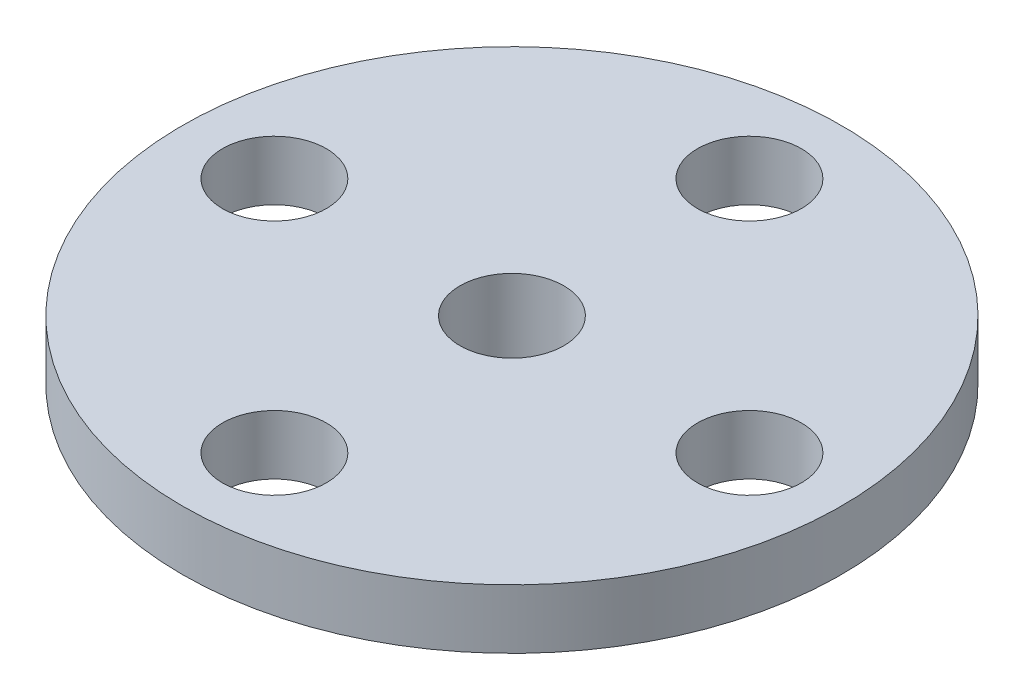
ISO-10303-21;
HEADER;
FILE_DESCRIPTION(('STEP AP214'),'2;1');
FILE_NAME('part.step','',(''),(''),'','','');
FILE_SCHEMA(('AUTOMOTIVE_DESIGN { 1 0 10303 214 1 1 1 1 }'));
ENDSEC;
DATA;
#1=APPLICATION_CONTEXT('core data for automotive mechanical design processes');
#2=APPLICATION_PROTOCOL_DEFINITION('international standard','automotive_design',2000,#1);
#3=PRODUCT_CONTEXT('',#1,'mechanical');
#4=PRODUCT('Part','Part','',(#3));
#5=PRODUCT_RELATED_PRODUCT_CATEGORY('part','',(#4));
#6=PRODUCT_DEFINITION_FORMATION('','',#4);
#7=PRODUCT_DEFINITION_CONTEXT('part definition',#1,'design');
#8=PRODUCT_DEFINITION('design','',#6,#7);
#9=PRODUCT_DEFINITION_SHAPE('','',#8);
#10=(LENGTH_UNIT() NAMED_UNIT(*) SI_UNIT(.MILLI.,.METRE.));
#11=(NAMED_UNIT(*) PLANE_ANGLE_UNIT() SI_UNIT($,.RADIAN.));
#12=(NAMED_UNIT(*) SI_UNIT($,.STERADIAN.) SOLID_ANGLE_UNIT());
#13=UNCERTAINTY_MEASURE_WITH_UNIT(LENGTH_MEASURE(1.E-05),#10,'distance_accuracy_value','');
#14=(GEOMETRIC_REPRESENTATION_CONTEXT(3) GLOBAL_UNCERTAINTY_ASSIGNED_CONTEXT((#13)) GLOBAL_UNIT_ASSIGNED_CONTEXT((#10,
#11,#12)) REPRESENTATION_CONTEXT('',''));
#15=CARTESIAN_POINT('',(0.,0.,0.));
#16=DIRECTION('',(0.,0.,1.));
#17=DIRECTION('',(1.,0.,0.));
#18=AXIS2_PLACEMENT_3D('',#15,#16,#17);
#19=CARTESIAN_POINT('',(0.,0.,0.));
#20=DIRECTION('',(0.,1.,0.));
#21=DIRECTION('',(0.,0.,1.));
#22=AXIS2_PLACEMENT_3D('',#19,#20,#21);
#23=PLANE('',#22);
#24=CARTESIAN_POINT('',(0.,0.,0.));
#25=DIRECTION('',(0.,1.,0.));
#26=DIRECTION('',(0.,0.,1.));
#27=AXIS2_PLACEMENT_3D('',#24,#25,#26);
#28=CIRCLE('',#27,11.1);
#29=CARTESIAN_POINT('',(0.,0.,11.1));
#30=VERTEX_POINT('',#29);
#31=EDGE_CURVE('E39',#30,#30,#28,.T.);
#32=ORIENTED_EDGE('',*,*,#31,.F.);
#33=EDGE_LOOP('',(#32));
#34=FACE_BOUND('',#33,.T.);
#35=CARTESIAN_POINT('',(0.,0.,-8.));
#36=DIRECTION('',(0.,1.,0.));
#37=DIRECTION('',(0.,0.,1.));
#38=AXIS2_PLACEMENT_3D('',#35,#36,#37);
#39=CIRCLE('',#38,1.75);
#40=CARTESIAN_POINT('',(0.,0.,-6.25));
#41=VERTEX_POINT('',#40);
#42=EDGE_CURVE('E44',#41,#41,#39,.T.);
#43=ORIENTED_EDGE('',*,*,#42,.T.);
#44=EDGE_LOOP('',(#43));
#45=FACE_BOUND('',#44,.T.);
#46=CARTESIAN_POINT('',(8.,0.,0.));
#47=DIRECTION('',(0.,1.,0.));
#48=DIRECTION('',(0.,0.,1.));
#49=AXIS2_PLACEMENT_3D('',#46,#47,#48);
#50=CIRCLE('',#49,1.75);
#51=CARTESIAN_POINT('',(8.,0.,1.75));
#52=VERTEX_POINT('',#51);
#53=EDGE_CURVE('E49',#52,#52,#50,.T.);
#54=ORIENTED_EDGE('',*,*,#53,.T.);
#55=EDGE_LOOP('',(#54));
#56=FACE_BOUND('',#55,.T.);
#57=CARTESIAN_POINT('',(0.,0.,8.));
#58=DIRECTION('',(0.,1.,0.));
#59=DIRECTION('',(0.,0.,1.));
#60=AXIS2_PLACEMENT_3D('',#57,#58,#59);
#61=CIRCLE('',#60,1.75);
#62=CARTESIAN_POINT('',(0.,0.,9.75));
#63=VERTEX_POINT('',#62);
#64=EDGE_CURVE('E55',#63,#63,#61,.T.);
#65=ORIENTED_EDGE('',*,*,#64,.T.);
#66=EDGE_LOOP('',(#65));
#67=FACE_BOUND('',#66,.T.);
#68=CARTESIAN_POINT('',(-8.,0.,0.));
#69=DIRECTION('',(0.,1.,0.));
#70=DIRECTION('',(0.,0.,1.));
#71=AXIS2_PLACEMENT_3D('',#68,#69,#70);
#72=CIRCLE('',#71,1.75);
#73=CARTESIAN_POINT('',(-8.,0.,1.75));
#74=VERTEX_POINT('',#73);
#75=EDGE_CURVE('E61',#74,#74,#72,.T.);
#76=ORIENTED_EDGE('',*,*,#75,.T.);
#77=EDGE_LOOP('',(#76));
#78=FACE_BOUND('',#77,.T.);
#79=CARTESIAN_POINT('',(0.,0.,0.));
#80=DIRECTION('',(0.,1.,0.));
#81=DIRECTION('',(0.,0.,1.));
#82=AXIS2_PLACEMENT_3D('',#79,#80,#81);
#83=CIRCLE('',#82,4.4);
#84=CARTESIAN_POINT('',(0.,0.,4.4));
#85=VERTEX_POINT('',#84);
#86=EDGE_CURVE('E10',#85,#85,#83,.F.);
#87=ORIENTED_EDGE('',*,*,#86,.F.);
#88=EDGE_LOOP('',(#87));
#89=FACE_BOUND('',#88,.T.);
#90=ADVANCED_FACE('F28',(#34,#45,#56,#67,#78,#89),#23,.F.);
#91=CARTESIAN_POINT('',(0.,2.,0.));
#92=DIRECTION('',(0.,-1.,0.));
#93=DIRECTION('',(0.,0.,-1.));
#94=AXIS2_PLACEMENT_3D('',#91,#92,#93);
#95=CYLINDRICAL_SURFACE('',#94,11.1);
#96=CARTESIAN_POINT('',(0.,2.,0.));
#97=DIRECTION('',(0.,1.,0.));
#98=DIRECTION('',(0.,0.,1.));
#99=AXIS2_PLACEMENT_3D('',#96,#97,#98);
#100=CIRCLE('',#99,11.1);
#101=CARTESIAN_POINT('',(0.,2.,11.1));
#102=VERTEX_POINT('',#101);
#103=EDGE_CURVE('E35',#102,#102,#100,.T.);
#104=ORIENTED_EDGE('',*,*,#103,.F.);
#105=EDGE_LOOP('',(#104));
#106=FACE_BOUND('',#105,.T.);
#107=ORIENTED_EDGE('',*,*,#31,.T.);
#108=EDGE_LOOP('',(#107));
#109=FACE_BOUND('',#108,.T.);
#110=ADVANCED_FACE('F30',(#106,#109),#95,.T.);
#111=CARTESIAN_POINT('',(0.,2.,0.));
#112=DIRECTION('',(0.,1.,0.));
#113=DIRECTION('',(0.,0.,1.));
#114=AXIS2_PLACEMENT_3D('',#111,#112,#113);
#115=PLANE('',#114);
#116=CARTESIAN_POINT('',(0.,2.,0.));
#117=DIRECTION('',(0.,-1.,0.));
#118=DIRECTION('',(0.,0.,-1.));
#119=AXIS2_PLACEMENT_3D('',#116,#117,#118);
#120=CIRCLE('',#119,1.75);
#121=CARTESIAN_POINT('',(0.,2.,-1.75));
#122=VERTEX_POINT('',#121);
#123=EDGE_CURVE('E76',#122,#122,#120,.T.);
#124=ORIENTED_EDGE('',*,*,#123,.T.);
#125=EDGE_LOOP('',(#124));
#126=FACE_BOUND('',#125,.T.);
#127=CARTESIAN_POINT('',(-8.,2.,0.));
#128=DIRECTION('',(0.,1.,0.));
#129=DIRECTION('',(0.,0.,1.));
#130=AXIS2_PLACEMENT_3D('',#127,#128,#129);
#131=CIRCLE('',#130,1.75);
#132=CARTESIAN_POINT('',(-8.,2.,1.75));
#133=VERTEX_POINT('',#132);
#134=EDGE_CURVE('E64',#133,#133,#131,.T.);
#135=ORIENTED_EDGE('',*,*,#134,.F.);
#136=EDGE_LOOP('',(#135));
#137=FACE_BOUND('',#136,.T.);
#138=CARTESIAN_POINT('',(0.,2.,8.));
#139=DIRECTION('',(0.,1.,0.));
#140=DIRECTION('',(0.,0.,1.));
#141=AXIS2_PLACEMENT_3D('',#138,#139,#140);
#142=CIRCLE('',#141,1.75);
#143=CARTESIAN_POINT('',(0.,2.,9.75));
#144=VERTEX_POINT('',#143);
#145=EDGE_CURVE('E58',#144,#144,#142,.T.);
#146=ORIENTED_EDGE('',*,*,#145,.F.);
#147=EDGE_LOOP('',(#146));
#148=FACE_BOUND('',#147,.T.);
#149=CARTESIAN_POINT('',(8.,2.,0.));
#150=DIRECTION('',(0.,1.,0.));
#151=DIRECTION('',(0.,0.,1.));
#152=AXIS2_PLACEMENT_3D('',#149,#150,#151);
#153=CIRCLE('',#152,1.75);
#154=CARTESIAN_POINT('',(8.,2.,1.75));
#155=VERTEX_POINT('',#154);
#156=EDGE_CURVE('E52',#155,#155,#153,.T.);
#157=ORIENTED_EDGE('',*,*,#156,.F.);
#158=EDGE_LOOP('',(#157));
#159=FACE_BOUND('',#158,.T.);
#160=CARTESIAN_POINT('',(0.,2.,-8.));
#161=DIRECTION('',(0.,1.,0.));
#162=DIRECTION('',(0.,0.,1.));
#163=AXIS2_PLACEMENT_3D('',#160,#161,#162);
#164=CIRCLE('',#163,1.75);
#165=CARTESIAN_POINT('',(0.,2.,-6.25));
#166=VERTEX_POINT('',#165);
#167=EDGE_CURVE('E46',#166,#166,#164,.T.);
#168=ORIENTED_EDGE('',*,*,#167,.F.);
#169=EDGE_LOOP('',(#168));
#170=FACE_BOUND('',#169,.T.);
#171=ORIENTED_EDGE('',*,*,#103,.T.);
#172=EDGE_LOOP('',(#171));
#173=FACE_BOUND('',#172,.T.);
#174=ADVANCED_FACE('F85',(#126,#137,#148,#159,#170,#173),#115,.T.);
#175=CARTESIAN_POINT('',(0.,0.,-8.));
#176=DIRECTION('',(0.,1.,0.));
#177=DIRECTION('',(0.,0.,1.));
#178=AXIS2_PLACEMENT_3D('',#175,#176,#177);
#179=CYLINDRICAL_SURFACE('',#178,1.75);
#180=ORIENTED_EDGE('',*,*,#42,.F.);
#181=EDGE_LOOP('',(#180));
#182=FACE_BOUND('',#181,.T.);
#183=ORIENTED_EDGE('',*,*,#167,.T.);
#184=EDGE_LOOP('',(#183));
#185=FACE_BOUND('',#184,.T.);
#186=ADVANCED_FACE('F133',(#182,#185),#179,.F.);
#187=CARTESIAN_POINT('',(8.,0.,0.));
#188=DIRECTION('',(0.,1.,0.));
#189=DIRECTION('',(0.,0.,1.));
#190=AXIS2_PLACEMENT_3D('',#187,#188,#189);
#191=CYLINDRICAL_SURFACE('',#190,1.75);
#192=ORIENTED_EDGE('',*,*,#53,.F.);
#193=EDGE_LOOP('',(#192));
#194=FACE_BOUND('',#193,.T.);
#195=ORIENTED_EDGE('',*,*,#156,.T.);
#196=EDGE_LOOP('',(#195));
#197=FACE_BOUND('',#196,.T.);
#198=ADVANCED_FACE('F136',(#194,#197),#191,.F.);
#199=CARTESIAN_POINT('',(0.,0.,8.));
#200=DIRECTION('',(0.,1.,0.));
#201=DIRECTION('',(0.,0.,1.));
#202=AXIS2_PLACEMENT_3D('',#199,#200,#201);
#203=CYLINDRICAL_SURFACE('',#202,1.75);
#204=ORIENTED_EDGE('',*,*,#64,.F.);
#205=EDGE_LOOP('',(#204));
#206=FACE_BOUND('',#205,.T.);
#207=ORIENTED_EDGE('',*,*,#145,.T.);
#208=EDGE_LOOP('',(#207));
#209=FACE_BOUND('',#208,.T.);
#210=ADVANCED_FACE('F119',(#206,#209),#203,.F.);
#211=CARTESIAN_POINT('',(-8.,0.,0.));
#212=DIRECTION('',(0.,1.,0.));
#213=DIRECTION('',(0.,0.,1.));
#214=AXIS2_PLACEMENT_3D('',#211,#212,#213);
#215=CYLINDRICAL_SURFACE('',#214,1.75);
#216=ORIENTED_EDGE('',*,*,#75,.F.);
#217=EDGE_LOOP('',(#216));
#218=FACE_BOUND('',#217,.T.);
#219=ORIENTED_EDGE('',*,*,#134,.T.);
#220=EDGE_LOOP('',(#219));
#221=FACE_BOUND('',#220,.T.);
#222=ADVANCED_FACE('F114',(#218,#221),#215,.F.);
#223=CARTESIAN_POINT('',(0.,-4.2,0.));
#224=DIRECTION('',(0.,1.,0.));
#225=DIRECTION('',(0.,0.,1.));
#226=AXIS2_PLACEMENT_3D('',#223,#224,#225);
#227=CYLINDRICAL_SURFACE('',#226,4.4);
#228=CARTESIAN_POINT('',(0.,-4.2,0.));
#229=DIRECTION('',(0.,-1.,0.));
#230=DIRECTION('',(0.,0.,-1.));
#231=AXIS2_PLACEMENT_3D('',#228,#229,#230);
#232=CIRCLE('',#231,4.4);
#233=CARTESIAN_POINT('',(0.,-4.2,-4.4));
#234=VERTEX_POINT('',#233);
#235=EDGE_CURVE('E67',#234,#234,#232,.T.);
#236=ORIENTED_EDGE('',*,*,#235,.F.);
#237=EDGE_LOOP('',(#236));
#238=FACE_BOUND('',#237,.T.);
#239=ORIENTED_EDGE('',*,*,#86,.T.);
#240=EDGE_LOOP('',(#239));
#241=FACE_BOUND('',#240,.T.);
#242=ADVANCED_FACE('F109',(#238,#241),#227,.T.);
#243=CARTESIAN_POINT('',(0.,-4.2,0.));
#244=DIRECTION('',(0.,-1.,0.));
#245=DIRECTION('',(0.,0.,-1.));
#246=AXIS2_PLACEMENT_3D('',#243,#244,#245);
#247=PLANE('',#246);
#248=CARTESIAN_POINT('',(0.,-4.2,0.));
#249=DIRECTION('',(0.,-1.,0.));
#250=DIRECTION('',(0.,0.,-1.));
#251=AXIS2_PLACEMENT_3D('',#248,#249,#250);
#252=CIRCLE('',#251,2.85);
#253=CARTESIAN_POINT('',(0.,-4.2,-2.85));
#254=VERTEX_POINT('',#253);
#255=EDGE_CURVE('E73',#254,#254,#252,.T.);
#256=ORIENTED_EDGE('',*,*,#255,.F.);
#257=EDGE_LOOP('',(#256));
#258=FACE_BOUND('',#257,.T.);
#259=ORIENTED_EDGE('',*,*,#235,.T.);
#260=EDGE_LOOP('',(#259));
#261=FACE_BOUND('',#260,.T.);
#262=ADVANCED_FACE('F103',(#258,#261),#247,.T.);
#263=CARTESIAN_POINT('',(0.,-1.2,0.));
#264=DIRECTION('',(0.,-1.,0.));
#265=DIRECTION('',(0.,0.,-1.));
#266=AXIS2_PLACEMENT_3D('',#263,#264,#265);
#267=CYLINDRICAL_SURFACE('',#266,2.85);
#268=CARTESIAN_POINT('',(0.,-1.2,0.));
#269=DIRECTION('',(0.,-1.,0.));
#270=DIRECTION('',(0.,0.,-1.));
#271=AXIS2_PLACEMENT_3D('',#268,#269,#270);
#272=CIRCLE('',#271,2.85);
#273=CARTESIAN_POINT('',(0.,-1.2,-2.85));
#274=VERTEX_POINT('',#273);
#275=EDGE_CURVE('E72',#274,#274,#272,.T.);
#276=ORIENTED_EDGE('',*,*,#275,.F.);
#277=EDGE_LOOP('',(#276));
#278=FACE_BOUND('',#277,.T.);
#279=ORIENTED_EDGE('',*,*,#255,.T.);
#280=EDGE_LOOP('',(#279));
#281=FACE_BOUND('',#280,.T.);
#282=ADVANCED_FACE('F97',(#278,#281),#267,.F.);
#283=CARTESIAN_POINT('',(0.,-1.2,0.));
#284=DIRECTION('',(0.,-1.,0.));
#285=DIRECTION('',(0.,0.,-1.));
#286=AXIS2_PLACEMENT_3D('',#283,#284,#285);
#287=PLANE('',#286);
#288=CARTESIAN_POINT('',(0.,-1.2,0.));
#289=DIRECTION('',(0.,-1.,0.));
#290=DIRECTION('',(0.,0.,-1.));
#291=AXIS2_PLACEMENT_3D('',#288,#289,#290);
#292=CIRCLE('',#291,1.75);
#293=CARTESIAN_POINT('',(0.,-1.2,-1.75));
#294=VERTEX_POINT('',#293);
#295=EDGE_CURVE('E79',#294,#294,#292,.T.);
#296=ORIENTED_EDGE('',*,*,#295,.F.);
#297=EDGE_LOOP('',(#296));
#298=FACE_BOUND('',#297,.T.);
#299=ORIENTED_EDGE('',*,*,#275,.T.);
#300=EDGE_LOOP('',(#299));
#301=FACE_BOUND('',#300,.T.);
#302=ADVANCED_FACE('F91',(#298,#301),#287,.T.);
#303=CARTESIAN_POINT('',(0.,2.,0.));
#304=DIRECTION('',(0.,-1.,0.));
#305=DIRECTION('',(0.,0.,-1.));
#306=AXIS2_PLACEMENT_3D('',#303,#304,#305);
#307=CYLINDRICAL_SURFACE('',#306,1.75);
#308=ORIENTED_EDGE('',*,*,#123,.F.);
#309=EDGE_LOOP('',(#308));
#310=FACE_BOUND('',#309,.T.);
#311=ORIENTED_EDGE('',*,*,#295,.T.);
#312=EDGE_LOOP('',(#311));
#313=FACE_BOUND('',#312,.T.);
#314=ADVANCED_FACE('F88',(#310,#313),#307,.F.);
#315=CLOSED_SHELL('',(#90,#110,#174,#186,#198,#210,#222,#242,#262,#282,#302,#314));
#316=MANIFOLD_SOLID_BREP('B2',#315);
#317=ADVANCED_BREP_SHAPE_REPRESENTATION('',(#18,#316),#14);
#318=SHAPE_DEFINITION_REPRESENTATION(#9,#317);
ENDSEC;
END-ISO-10303-21;
